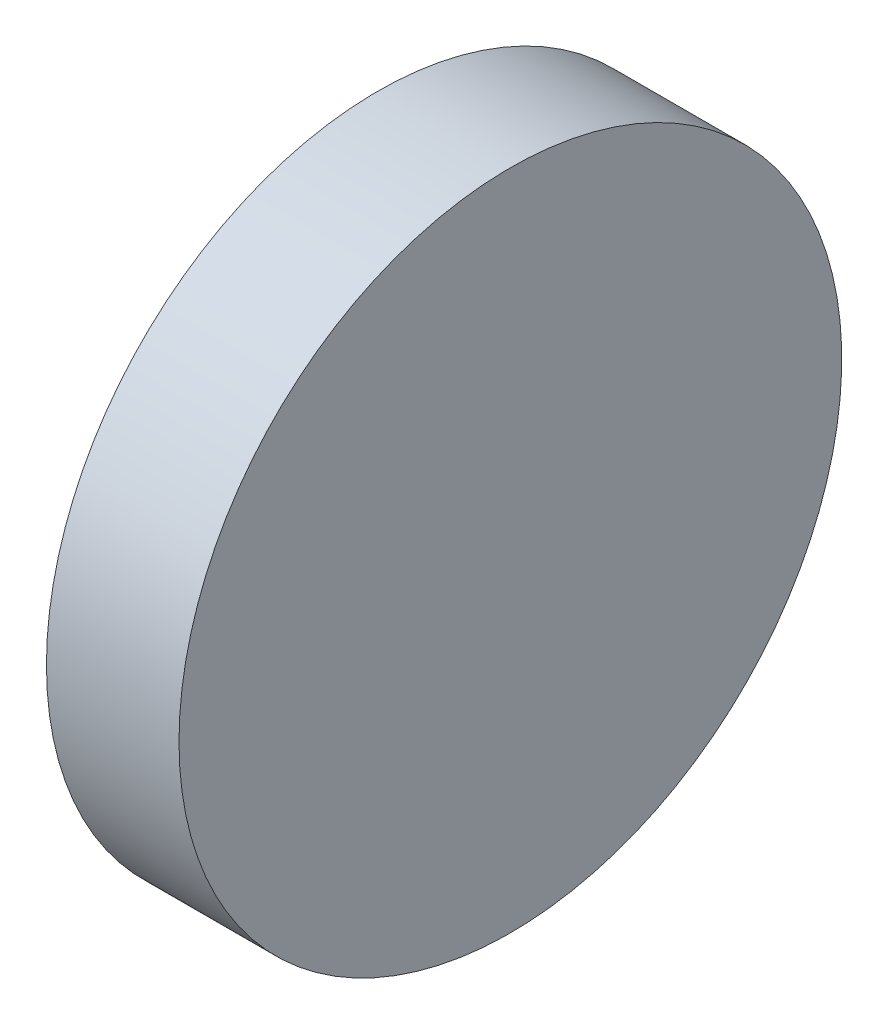
ISO-10303-21;
HEADER;
FILE_DESCRIPTION(('STEP AP214'),'2;1');
FILE_NAME('part.step','',(''),(''),'','','');
FILE_SCHEMA(('AUTOMOTIVE_DESIGN { 1 0 10303 214 1 1 1 1 }'));
ENDSEC;
DATA;
#1=APPLICATION_CONTEXT('core data for automotive mechanical design processes');
#2=APPLICATION_PROTOCOL_DEFINITION('international standard','automotive_design',2000,#1);
#3=PRODUCT_CONTEXT('',#1,'mechanical');
#4=PRODUCT('Part','Part','',(#3));
#5=PRODUCT_RELATED_PRODUCT_CATEGORY('part','',(#4));
#6=PRODUCT_DEFINITION_FORMATION('','',#4);
#7=PRODUCT_DEFINITION_CONTEXT('part definition',#1,'design');
#8=PRODUCT_DEFINITION('design','',#6,#7);
#9=PRODUCT_DEFINITION_SHAPE('','',#8);
#10=(LENGTH_UNIT() NAMED_UNIT(*) SI_UNIT(.MILLI.,.METRE.));
#11=(NAMED_UNIT(*) PLANE_ANGLE_UNIT() SI_UNIT($,.RADIAN.));
#12=(NAMED_UNIT(*) SI_UNIT($,.STERADIAN.) SOLID_ANGLE_UNIT());
#13=UNCERTAINTY_MEASURE_WITH_UNIT(LENGTH_MEASURE(1.E-05),#10,'distance_accuracy_value','');
#14=(GEOMETRIC_REPRESENTATION_CONTEXT(3) GLOBAL_UNCERTAINTY_ASSIGNED_CONTEXT((#13)) GLOBAL_UNIT_ASSIGNED_CONTEXT((#10,
#11,#12)) REPRESENTATION_CONTEXT('',''));
#15=CARTESIAN_POINT('',(0.,0.,0.));
#16=DIRECTION('',(0.,0.,1.));
#17=DIRECTION('',(1.,0.,0.));
#18=AXIS2_PLACEMENT_3D('',#15,#16,#17);
#19=CARTESIAN_POINT('',(3.,12.7,0.));
#20=DIRECTION('',(-1.,0.,0.));
#21=DIRECTION('',(0.,0.,1.));
#22=AXIS2_PLACEMENT_3D('',#19,#20,#21);
#23=PLANE('',#22);
#24=CARTESIAN_POINT('',(3.,0.,0.));
#25=DIRECTION('',(-1.,0.,0.));
#26=DIRECTION('',(0.,0.,1.));
#27=AXIS2_PLACEMENT_3D('',#24,#25,#26);
#28=CIRCLE('',#27,15.);
#29=CARTESIAN_POINT('',(3.,0.,15.));
#30=VERTEX_POINT('',#29);
#31=EDGE_CURVE('E44',#30,#30,#28,.T.);
#32=ORIENTED_EDGE('',*,*,#31,.F.);
#33=EDGE_LOOP('',(#32));
#34=FACE_BOUND('',#33,.T.);
#35=ADVANCED_FACE('F37',(#34),#23,.F.);
#36=CARTESIAN_POINT('',(-1.61421241885762,0.,0.));
#37=DIRECTION('',(-1.,0.,0.));
#38=DIRECTION('',(0.,0.,1.));
#39=AXIS2_PLACEMENT_3D('',#36,#37,#38);
#40=CYLINDRICAL_SURFACE('',#39,15.);
#41=CARTESIAN_POINT('',(-3.,0.,0.));
#42=DIRECTION('',(-1.,0.,0.));
#43=DIRECTION('',(0.,0.,1.));
#44=AXIS2_PLACEMENT_3D('',#41,#42,#43);
#45=CIRCLE('',#44,15.);
#46=CARTESIAN_POINT('',(-3.,0.,15.));
#47=VERTEX_POINT('',#46);
#48=EDGE_CURVE('E10',#47,#47,#45,.T.);
#49=ORIENTED_EDGE('',*,*,#48,.F.);
#50=EDGE_LOOP('',(#49));
#51=FACE_BOUND('',#50,.T.);
#52=ORIENTED_EDGE('',*,*,#31,.T.);
#53=EDGE_LOOP('',(#52));
#54=FACE_BOUND('',#53,.T.);
#55=ADVANCED_FACE('F51',(#51,#54),#40,.T.);
#56=CARTESIAN_POINT('',(-3.,12.7,0.));
#57=DIRECTION('',(1.,0.,0.));
#58=DIRECTION('',(0.,0.,-1.));
#59=AXIS2_PLACEMENT_3D('',#56,#57,#58);
#60=PLANE('',#59);
#61=ORIENTED_EDGE('',*,*,#48,.T.);
#62=EDGE_LOOP('',(#61));
#63=FACE_BOUND('',#62,.T.);
#64=ADVANCED_FACE('F57',(#63),#60,.F.);
#65=CLOSED_SHELL('',(#35,#55,#64));
#66=MANIFOLD_SOLID_BREP('B2',#65);
#67=ADVANCED_BREP_SHAPE_REPRESENTATION('',(#18,#66),#14);
#68=SHAPE_DEFINITION_REPRESENTATION(#9,#67);
ENDSEC;
END-ISO-10303-21;
